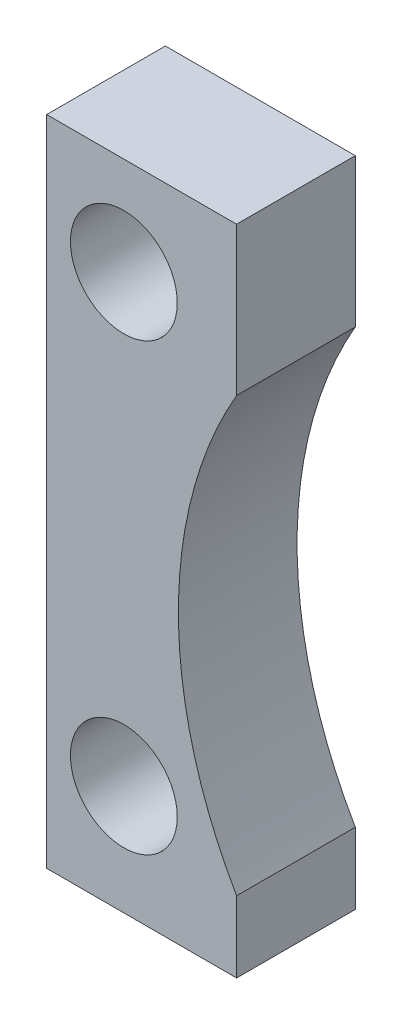
ISO-10303-21;
HEADER;
FILE_DESCRIPTION(('STEP AP214'),'2;1');
FILE_NAME('part.step','',(''),(''),'','','');
FILE_SCHEMA(('AUTOMOTIVE_DESIGN { 1 0 10303 214 1 1 1 1 }'));
ENDSEC;
DATA;
#1=APPLICATION_CONTEXT('core data for automotive mechanical design processes');
#2=APPLICATION_PROTOCOL_DEFINITION('international standard','automotive_design',2000,#1);
#3=PRODUCT_CONTEXT('',#1,'mechanical');
#4=PRODUCT('Part','Part','',(#3));
#5=PRODUCT_RELATED_PRODUCT_CATEGORY('part','',(#4));
#6=PRODUCT_DEFINITION_FORMATION('','',#4);
#7=PRODUCT_DEFINITION_CONTEXT('part definition',#1,'design');
#8=PRODUCT_DEFINITION('design','',#6,#7);
#9=PRODUCT_DEFINITION_SHAPE('','',#8);
#10=(LENGTH_UNIT() NAMED_UNIT(*) SI_UNIT(.MILLI.,.METRE.));
#11=(NAMED_UNIT(*) PLANE_ANGLE_UNIT() SI_UNIT($,.RADIAN.));
#12=(NAMED_UNIT(*) SI_UNIT($,.STERADIAN.) SOLID_ANGLE_UNIT());
#13=UNCERTAINTY_MEASURE_WITH_UNIT(LENGTH_MEASURE(1.E-05),#10,'distance_accuracy_value','');
#14=(GEOMETRIC_REPRESENTATION_CONTEXT(3) GLOBAL_UNCERTAINTY_ASSIGNED_CONTEXT((#13)) GLOBAL_UNIT_ASSIGNED_CONTEXT((#10,
#11,#12)) REPRESENTATION_CONTEXT('',''));
#15=CARTESIAN_POINT('',(0.,0.,0.));
#16=DIRECTION('',(0.,0.,1.));
#17=DIRECTION('',(1.,0.,0.));
#18=AXIS2_PLACEMENT_3D('',#15,#16,#17);
#19=CARTESIAN_POINT('',(0.,0.,10.));
#20=DIRECTION('',(0.,1.,0.));
#21=DIRECTION('',(0.,0.,1.));
#22=AXIS2_PLACEMENT_3D('',#19,#20,#21);
#23=PLANE('',#22);
#24=DIRECTION('',(1.,0.,0.));
#25=VECTOR('',#24,1.);
#26=CARTESIAN_POINT('',(0.,0.,-10.));
#27=LINE('',#26,#25);
#28=CARTESIAN_POINT('',(0.,0.,-10.));
#29=VERTEX_POINT('',#28);
#30=CARTESIAN_POINT('',(32.,0.,-10.));
#31=VERTEX_POINT('',#30);
#32=EDGE_CURVE('E118',#29,#31,#27,.T.);
#33=ORIENTED_EDGE('',*,*,#32,.T.);
#34=DIRECTION('',(0.,0.,-1.));
#35=VECTOR('',#34,1.);
#36=CARTESIAN_POINT('',(32.,0.,10.));
#37=LINE('',#36,#35);
#38=CARTESIAN_POINT('',(32.,0.,10.));
#39=VERTEX_POINT('',#38);
#40=EDGE_CURVE('E11',#39,#31,#37,.T.);
#41=ORIENTED_EDGE('',*,*,#40,.F.);
#42=DIRECTION('',(1.,0.,0.));
#43=VECTOR('',#42,1.);
#44=CARTESIAN_POINT('',(0.,0.,10.));
#45=LINE('',#44,#43);
#46=CARTESIAN_POINT('',(0.,0.,10.));
#47=VERTEX_POINT('',#46);
#48=EDGE_CURVE('E129',#47,#39,#45,.T.);
#49=ORIENTED_EDGE('',*,*,#48,.F.);
#50=DIRECTION('',(0.,0.,-1.));
#51=VECTOR('',#50,1.);
#52=CARTESIAN_POINT('',(0.,0.,10.));
#53=LINE('',#52,#51);
#54=EDGE_CURVE('E114',#47,#29,#53,.T.);
#55=ORIENTED_EDGE('',*,*,#54,.T.);
#56=EDGE_LOOP('',(#33,#41,#49,#55));
#57=FACE_BOUND('',#56,.T.);
#58=ADVANCED_FACE('F34',(#57),#23,.F.);
#59=CARTESIAN_POINT('',(32.,0.,10.));
#60=DIRECTION('',(-1.,0.,0.));
#61=DIRECTION('',(0.,-1.,0.));
#62=AXIS2_PLACEMENT_3D('',#59,#60,#61);
#63=PLANE('',#62);
#64=DIRECTION('',(0.,1.,0.));
#65=VECTOR('',#64,1.);
#66=CARTESIAN_POINT('',(32.,0.,-10.));
#67=LINE('',#66,#65);
#68=CARTESIAN_POINT('',(32.,12.,-10.));
#69=VERTEX_POINT('',#68);
#70=EDGE_CURVE('E121',#31,#69,#67,.T.);
#71=ORIENTED_EDGE('',*,*,#70,.T.);
#72=DIRECTION('',(0.,0.,-1.));
#73=VECTOR('',#72,1.);
#74=CARTESIAN_POINT('',(32.,12.,10.));
#75=LINE('',#74,#73);
#76=CARTESIAN_POINT('',(32.,12.,10.));
#77=VERTEX_POINT('',#76);
#78=EDGE_CURVE('E42',#77,#69,#75,.T.);
#79=ORIENTED_EDGE('',*,*,#78,.F.);
#80=DIRECTION('',(0.,1.,0.));
#81=VECTOR('',#80,1.);
#82=CARTESIAN_POINT('',(32.,0.,10.));
#83=LINE('',#82,#81);
#84=EDGE_CURVE('E87',#39,#77,#83,.T.);
#85=ORIENTED_EDGE('',*,*,#84,.F.);
#86=ORIENTED_EDGE('',*,*,#40,.T.);
#87=EDGE_LOOP('',(#71,#79,#85,#86));
#88=FACE_BOUND('',#87,.T.);
#89=ADVANCED_FACE('F154',(#88),#63,.F.);
#90=CARTESIAN_POINT('',(95.,48.5,10.));
#91=DIRECTION('',(0.,0.,-1.));
#92=DIRECTION('',(-1.,0.,0.));
#93=AXIS2_PLACEMENT_3D('',#90,#91,#92);
#94=CYLINDRICAL_SURFACE('',#93,72.8096834219185);
#95=CARTESIAN_POINT('',(95.,48.5,-10.));
#96=DIRECTION('',(0.,0.,-1.));
#97=DIRECTION('',(-1.,0.,0.));
#98=AXIS2_PLACEMENT_3D('',#95,#96,#97);
#99=CIRCLE('',#98,72.8096834219185);
#100=CARTESIAN_POINT('',(32.,85.,-10.));
#101=VERTEX_POINT('',#100);
#102=EDGE_CURVE('E124',#69,#101,#99,.T.);
#103=ORIENTED_EDGE('',*,*,#102,.T.);
#104=DIRECTION('',(0.,0.,-1.));
#105=VECTOR('',#104,1.);
#106=CARTESIAN_POINT('',(32.,85.,10.));
#107=LINE('',#106,#105);
#108=CARTESIAN_POINT('',(32.,85.,10.));
#109=VERTEX_POINT('',#108);
#110=EDGE_CURVE('E109',#109,#101,#107,.T.);
#111=ORIENTED_EDGE('',*,*,#110,.F.);
#112=CARTESIAN_POINT('',(95.,48.5,10.));
#113=DIRECTION('',(0.,0.,-1.));
#114=DIRECTION('',(-1.,0.,0.));
#115=AXIS2_PLACEMENT_3D('',#112,#113,#114);
#116=CIRCLE('',#115,72.8096834219185);
#117=EDGE_CURVE('E100',#77,#109,#116,.T.);
#118=ORIENTED_EDGE('',*,*,#117,.F.);
#119=ORIENTED_EDGE('',*,*,#78,.T.);
#120=EDGE_LOOP('',(#103,#111,#118,#119));
#121=FACE_BOUND('',#120,.T.);
#122=ADVANCED_FACE('F135',(#121),#94,.F.);
#123=CARTESIAN_POINT('',(32.,110.,10.));
#124=DIRECTION('',(-1.,0.,0.));
#125=DIRECTION('',(0.,-1.,0.));
#126=AXIS2_PLACEMENT_3D('',#123,#124,#125);
#127=PLANE('',#126);
#128=DIRECTION('',(0.,1.,0.));
#129=VECTOR('',#128,1.);
#130=CARTESIAN_POINT('',(32.,110.,-10.));
#131=LINE('',#130,#129);
#132=CARTESIAN_POINT('',(32.,110.,-10.));
#133=VERTEX_POINT('',#132);
#134=EDGE_CURVE('E108',#101,#133,#131,.T.);
#135=ORIENTED_EDGE('',*,*,#134,.T.);
#136=DIRECTION('',(0.,0.,-1.));
#137=VECTOR('',#136,1.);
#138=CARTESIAN_POINT('',(32.,110.,10.));
#139=LINE('',#138,#137);
#140=CARTESIAN_POINT('',(32.,110.,10.));
#141=VERTEX_POINT('',#140);
#142=EDGE_CURVE('E105',#141,#133,#139,.T.);
#143=ORIENTED_EDGE('',*,*,#142,.F.);
#144=DIRECTION('',(0.,1.,0.));
#145=VECTOR('',#144,1.);
#146=CARTESIAN_POINT('',(32.,110.,10.));
#147=LINE('',#146,#145);
#148=EDGE_CURVE('E94',#109,#141,#147,.T.);
#149=ORIENTED_EDGE('',*,*,#148,.F.);
#150=ORIENTED_EDGE('',*,*,#110,.T.);
#151=EDGE_LOOP('',(#135,#143,#149,#150));
#152=FACE_BOUND('',#151,.T.);
#153=ADVANCED_FACE('F106',(#152),#127,.F.);
#154=CARTESIAN_POINT('',(0.,110.,10.));
#155=DIRECTION('',(0.,-1.,0.));
#156=DIRECTION('',(0.,0.,-1.));
#157=AXIS2_PLACEMENT_3D('',#154,#155,#156);
#158=PLANE('',#157);
#159=DIRECTION('',(-1.,0.,0.));
#160=VECTOR('',#159,1.);
#161=CARTESIAN_POINT('',(0.,110.,-10.));
#162=LINE('',#161,#160);
#163=CARTESIAN_POINT('',(0.,110.,-10.));
#164=VERTEX_POINT('',#163);
#165=EDGE_CURVE('E73',#133,#164,#162,.T.);
#166=ORIENTED_EDGE('',*,*,#165,.T.);
#167=DIRECTION('',(0.,0.,-1.));
#168=VECTOR('',#167,1.);
#169=CARTESIAN_POINT('',(0.,110.,10.));
#170=LINE('',#169,#168);
#171=CARTESIAN_POINT('',(0.,110.,10.));
#172=VERTEX_POINT('',#171);
#173=EDGE_CURVE('E110',#172,#164,#170,.T.);
#174=ORIENTED_EDGE('',*,*,#173,.F.);
#175=DIRECTION('',(-1.,0.,0.));
#176=VECTOR('',#175,1.);
#177=CARTESIAN_POINT('',(0.,110.,10.));
#178=LINE('',#177,#176);
#179=EDGE_CURVE('E98',#141,#172,#178,.T.);
#180=ORIENTED_EDGE('',*,*,#179,.F.);
#181=ORIENTED_EDGE('',*,*,#142,.T.);
#182=EDGE_LOOP('',(#166,#174,#180,#181));
#183=FACE_BOUND('',#182,.T.);
#184=ADVANCED_FACE('F112',(#183),#158,.F.);
#185=CARTESIAN_POINT('',(0.,0.,10.));
#186=DIRECTION('',(1.,0.,0.));
#187=DIRECTION('',(0.,0.,-1.));
#188=AXIS2_PLACEMENT_3D('',#185,#186,#187);
#189=PLANE('',#188);
#190=DIRECTION('',(0.,-1.,0.));
#191=VECTOR('',#190,1.);
#192=CARTESIAN_POINT('',(0.,0.,-10.));
#193=LINE('',#192,#191);
#194=EDGE_CURVE('E79',#164,#29,#193,.T.);
#195=ORIENTED_EDGE('',*,*,#194,.T.);
#196=ORIENTED_EDGE('',*,*,#54,.F.);
#197=DIRECTION('',(0.,-1.,0.));
#198=VECTOR('',#197,1.);
#199=CARTESIAN_POINT('',(0.,0.,10.));
#200=LINE('',#199,#198);
#201=EDGE_CURVE('E50',#172,#47,#200,.T.);
#202=ORIENTED_EDGE('',*,*,#201,.F.);
#203=ORIENTED_EDGE('',*,*,#173,.T.);
#204=EDGE_LOOP('',(#195,#196,#202,#203));
#205=FACE_BOUND('',#204,.T.);
#206=ADVANCED_FACE('F142',(#205),#189,.F.);
#207=CARTESIAN_POINT('',(95.,48.5,10.));
#208=DIRECTION('',(0.,0.,-1.));
#209=DIRECTION('',(-1.,0.,0.));
#210=AXIS2_PLACEMENT_3D('',#207,#208,#209);
#211=PLANE('',#210);
#212=CARTESIAN_POINT('',(13.,93.5,10.));
#213=DIRECTION('',(0.,0.,1.));
#214=DIRECTION('',(1.,0.,0.));
#215=AXIS2_PLACEMENT_3D('',#212,#213,#214);
#216=CIRCLE('',#215,9.00000000000002);
#217=CARTESIAN_POINT('',(22.0000000000001,93.5,10.));
#218=VERTEX_POINT('',#217);
#219=EDGE_CURVE('E219',#218,#218,#216,.T.);
#220=ORIENTED_EDGE('',*,*,#219,.F.);
#221=EDGE_LOOP('',(#220));
#222=FACE_BOUND('',#221,.T.);
#223=CARTESIAN_POINT('',(13.0000000000001,18.5,10.));
#224=DIRECTION('',(0.,0.,1.));
#225=DIRECTION('',(1.,0.,0.));
#226=AXIS2_PLACEMENT_3D('',#223,#224,#225);
#227=CIRCLE('',#226,9.);
#228=CARTESIAN_POINT('',(22.0000000000001,18.5,10.));
#229=VERTEX_POINT('',#228);
#230=EDGE_CURVE('E224',#229,#229,#227,.T.);
#231=ORIENTED_EDGE('',*,*,#230,.F.);
#232=EDGE_LOOP('',(#231));
#233=FACE_BOUND('',#232,.T.);
#234=ORIENTED_EDGE('',*,*,#48,.T.);
#235=ORIENTED_EDGE('',*,*,#84,.T.);
#236=ORIENTED_EDGE('',*,*,#117,.T.);
#237=ORIENTED_EDGE('',*,*,#148,.T.);
#238=ORIENTED_EDGE('',*,*,#179,.T.);
#239=ORIENTED_EDGE('',*,*,#201,.T.);
#240=EDGE_LOOP('',(#234,#235,#236,#237,#238,#239));
#241=FACE_BOUND('',#240,.T.);
#242=ADVANCED_FACE('F96',(#222,#233,#241),#211,.F.);
#243=CARTESIAN_POINT('',(95.,48.5,-10.));
#244=DIRECTION('',(0.,0.,-1.));
#245=DIRECTION('',(-1.,0.,0.));
#246=AXIS2_PLACEMENT_3D('',#243,#244,#245);
#247=PLANE('',#246);
#248=CARTESIAN_POINT('',(13.,93.5,-10.));
#249=DIRECTION('',(0.,0.,1.));
#250=DIRECTION('',(1.,0.,0.));
#251=AXIS2_PLACEMENT_3D('',#248,#249,#250);
#252=CIRCLE('',#251,9.00000000000002);
#253=CARTESIAN_POINT('',(22.0000000000001,93.5,-10.));
#254=VERTEX_POINT('',#253);
#255=EDGE_CURVE('E122',#254,#254,#252,.T.);
#256=ORIENTED_EDGE('',*,*,#255,.T.);
#257=EDGE_LOOP('',(#256));
#258=FACE_BOUND('',#257,.T.);
#259=CARTESIAN_POINT('',(13.0000000000001,18.5,-10.));
#260=DIRECTION('',(0.,0.,1.));
#261=DIRECTION('',(1.,0.,0.));
#262=AXIS2_PLACEMENT_3D('',#259,#260,#261);
#263=CIRCLE('',#262,9.);
#264=CARTESIAN_POINT('',(22.0000000000001,18.5,-10.));
#265=VERTEX_POINT('',#264);
#266=EDGE_CURVE('E220',#265,#265,#263,.T.);
#267=ORIENTED_EDGE('',*,*,#266,.T.);
#268=EDGE_LOOP('',(#267));
#269=FACE_BOUND('',#268,.T.);
#270=ORIENTED_EDGE('',*,*,#32,.F.);
#271=ORIENTED_EDGE('',*,*,#194,.F.);
#272=ORIENTED_EDGE('',*,*,#165,.F.);
#273=ORIENTED_EDGE('',*,*,#134,.F.);
#274=ORIENTED_EDGE('',*,*,#102,.F.);
#275=ORIENTED_EDGE('',*,*,#70,.F.);
#276=EDGE_LOOP('',(#270,#271,#272,#273,#274,#275));
#277=FACE_BOUND('',#276,.T.);
#278=ADVANCED_FACE('F138',(#258,#269,#277),#247,.T.);
#279=CARTESIAN_POINT('',(13.0000000000001,18.5,-10.));
#280=DIRECTION('',(0.,0.,1.));
#281=DIRECTION('',(1.,0.,0.));
#282=AXIS2_PLACEMENT_3D('',#279,#280,#281);
#283=CYLINDRICAL_SURFACE('',#282,9.);
#284=ORIENTED_EDGE('',*,*,#266,.F.);
#285=EDGE_LOOP('',(#284));
#286=FACE_BOUND('',#285,.T.);
#287=ORIENTED_EDGE('',*,*,#230,.T.);
#288=EDGE_LOOP('',(#287));
#289=FACE_BOUND('',#288,.T.);
#290=ADVANCED_FACE('F191',(#286,#289),#283,.F.);
#291=CARTESIAN_POINT('',(13.,93.5,-10.));
#292=DIRECTION('',(0.,0.,1.));
#293=DIRECTION('',(1.,0.,0.));
#294=AXIS2_PLACEMENT_3D('',#291,#292,#293);
#295=CYLINDRICAL_SURFACE('',#294,9.00000000000002);
#296=ORIENTED_EDGE('',*,*,#255,.F.);
#297=EDGE_LOOP('',(#296));
#298=FACE_BOUND('',#297,.T.);
#299=ORIENTED_EDGE('',*,*,#219,.T.);
#300=EDGE_LOOP('',(#299));
#301=FACE_BOUND('',#300,.T.);
#302=ADVANCED_FACE('F200',(#298,#301),#295,.F.);
#303=CLOSED_SHELL('',(#58,#89,#122,#153,#184,#206,#242,#278,#290,#302));
#304=MANIFOLD_SOLID_BREP('B2',#303);
#305=ADVANCED_BREP_SHAPE_REPRESENTATION('',(#18,#304),#14);
#306=SHAPE_DEFINITION_REPRESENTATION(#9,#305);
ENDSEC;
END-ISO-10303-21;
